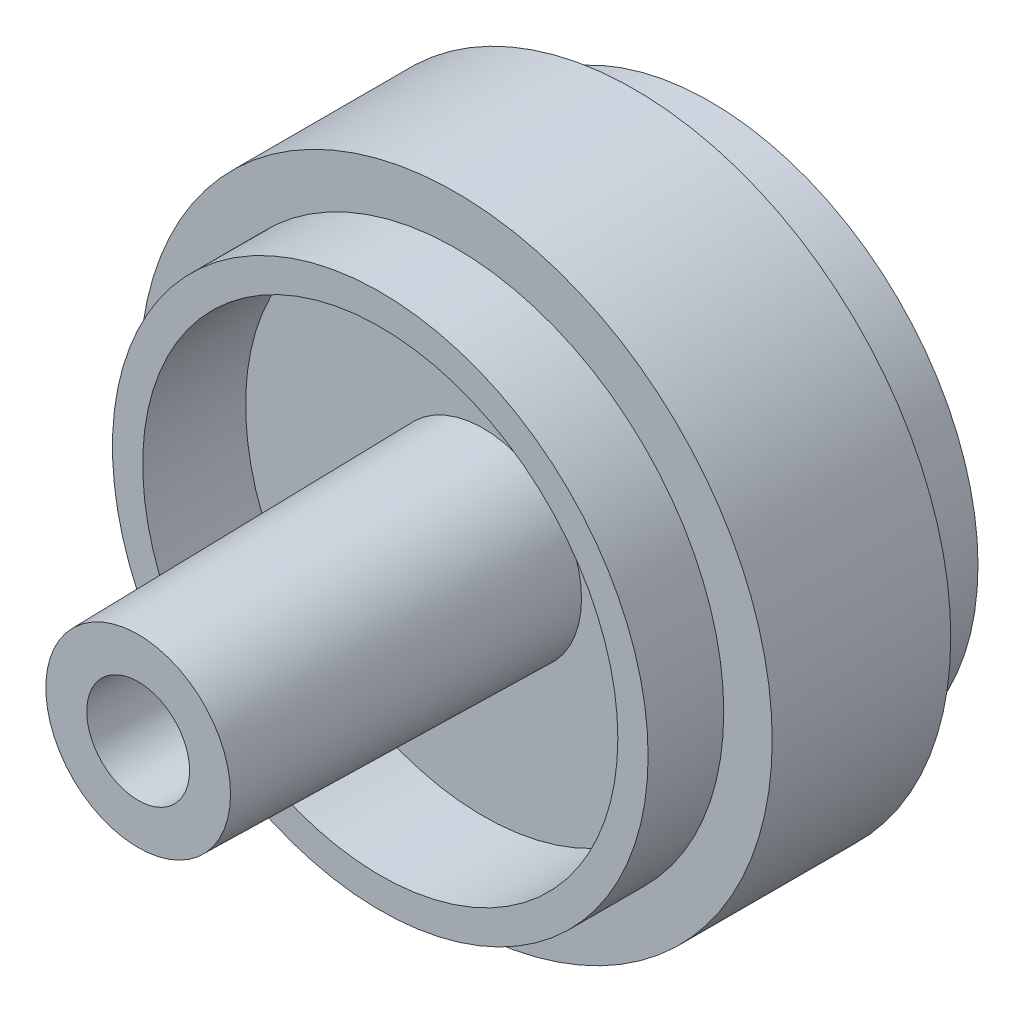
ISO-10303-21;
HEADER;
FILE_DESCRIPTION(('STEP AP214'),'2;1');
FILE_NAME('part.step','',(''),(''),'','','');
FILE_SCHEMA(('AUTOMOTIVE_DESIGN { 1 0 10303 214 1 1 1 1 }'));
ENDSEC;
DATA;
#1=APPLICATION_CONTEXT('core data for automotive mechanical design processes');
#2=APPLICATION_PROTOCOL_DEFINITION('international standard','automotive_design',2000,#1);
#3=PRODUCT_CONTEXT('',#1,'mechanical');
#4=PRODUCT('Part','Part','',(#3));
#5=PRODUCT_RELATED_PRODUCT_CATEGORY('part','',(#4));
#6=PRODUCT_DEFINITION_FORMATION('','',#4);
#7=PRODUCT_DEFINITION_CONTEXT('part definition',#1,'design');
#8=PRODUCT_DEFINITION('design','',#6,#7);
#9=PRODUCT_DEFINITION_SHAPE('','',#8);
#10=(LENGTH_UNIT() NAMED_UNIT(*) SI_UNIT(.MILLI.,.METRE.));
#11=(NAMED_UNIT(*) PLANE_ANGLE_UNIT() SI_UNIT($,.RADIAN.));
#12=(NAMED_UNIT(*) SI_UNIT($,.STERADIAN.) SOLID_ANGLE_UNIT());
#13=UNCERTAINTY_MEASURE_WITH_UNIT(LENGTH_MEASURE(1.E-05),#10,'distance_accuracy_value','');
#14=(GEOMETRIC_REPRESENTATION_CONTEXT(3) GLOBAL_UNCERTAINTY_ASSIGNED_CONTEXT((#13)) GLOBAL_UNIT_ASSIGNED_CONTEXT((#10,
#11,#12)) REPRESENTATION_CONTEXT('',''));
#15=CARTESIAN_POINT('',(0.,0.,0.));
#16=DIRECTION('',(0.,0.,1.));
#17=DIRECTION('',(1.,0.,0.));
#18=AXIS2_PLACEMENT_3D('',#15,#16,#17);
#19=CARTESIAN_POINT('',(0.,0.,8.83385145527518));
#20=DIRECTION('',(0.,0.,1.));
#21=DIRECTION('',(1.,0.,0.));
#22=AXIS2_PLACEMENT_3D('',#19,#20,#21);
#23=CYLINDRICAL_SURFACE('',#22,3.25);
#24=CARTESIAN_POINT('',(0.,0.,-5.45));
#25=DIRECTION('',(0.,0.,1.));
#26=DIRECTION('',(1.,0.,0.));
#27=AXIS2_PLACEMENT_3D('',#24,#25,#26);
#28=CIRCLE('',#27,3.25);
#29=CARTESIAN_POINT('',(3.25,0.,-5.45));
#30=VERTEX_POINT('',#29);
#31=EDGE_CURVE('E83',#30,#30,#28,.T.);
#32=ORIENTED_EDGE('',*,*,#31,.F.);
#33=EDGE_LOOP('',(#32));
#34=FACE_BOUND('',#33,.T.);
#35=CARTESIAN_POINT('',(0.,0.,1.05));
#36=DIRECTION('',(0.,0.,1.));
#37=DIRECTION('',(1.,0.,0.));
#38=AXIS2_PLACEMENT_3D('',#35,#36,#37);
#39=CIRCLE('',#38,3.25);
#40=CARTESIAN_POINT('',(3.25,0.,1.05));
#41=VERTEX_POINT('',#40);
#42=EDGE_CURVE('E10',#41,#41,#39,.F.);
#43=ORIENTED_EDGE('',*,*,#42,.F.);
#44=EDGE_LOOP('',(#43));
#45=FACE_BOUND('',#44,.T.);
#46=ADVANCED_FACE('F33',(#34,#45),#23,.F.);
#47=CARTESIAN_POINT('',(0.,3.25,-5.45));
#48=DIRECTION('',(0.,0.,1.));
#49=DIRECTION('',(1.,0.,0.));
#50=AXIS2_PLACEMENT_3D('',#47,#48,#49);
#51=PLANE('',#50);
#52=CARTESIAN_POINT('',(0.,0.,-5.45));
#53=DIRECTION('',(0.,0.,1.));
#54=DIRECTION('',(1.,0.,0.));
#55=AXIS2_PLACEMENT_3D('',#52,#53,#54);
#56=CIRCLE('',#55,4.25);
#57=CARTESIAN_POINT('',(4.25,0.,-5.45));
#58=VERTEX_POINT('',#57);
#59=EDGE_CURVE('E40',#58,#58,#56,.T.);
#60=ORIENTED_EDGE('',*,*,#59,.F.);
#61=EDGE_LOOP('',(#60));
#62=FACE_BOUND('',#61,.T.);
#63=ORIENTED_EDGE('',*,*,#31,.T.);
#64=EDGE_LOOP('',(#63));
#65=FACE_BOUND('',#64,.T.);
#66=ADVANCED_FACE('F35',(#62,#65),#51,.F.);
#67=CARTESIAN_POINT('',(0.,0.,8.83385145527518));
#68=DIRECTION('',(0.,0.,1.));
#69=DIRECTION('',(1.,0.,0.));
#70=AXIS2_PLACEMENT_3D('',#67,#68,#69);
#71=CYLINDRICAL_SURFACE('',#70,4.25);
#72=CARTESIAN_POINT('',(0.,0.,-2.05));
#73=DIRECTION('',(0.,0.,1.));
#74=DIRECTION('',(1.,0.,0.));
#75=AXIS2_PLACEMENT_3D('',#72,#73,#74);
#76=CIRCLE('',#75,4.25);
#77=CARTESIAN_POINT('',(4.25,0.,-2.05));
#78=VERTEX_POINT('',#77);
#79=EDGE_CURVE('E44',#78,#78,#76,.T.);
#80=ORIENTED_EDGE('',*,*,#79,.F.);
#81=EDGE_LOOP('',(#80));
#82=FACE_BOUND('',#81,.T.);
#83=ORIENTED_EDGE('',*,*,#59,.T.);
#84=EDGE_LOOP('',(#83));
#85=FACE_BOUND('',#84,.T.);
#86=ADVANCED_FACE('F119',(#82,#85),#71,.T.);
#87=CARTESIAN_POINT('',(0.,4.25,-2.05));
#88=DIRECTION('',(0.,0.,1.));
#89=DIRECTION('',(1.,0.,0.));
#90=AXIS2_PLACEMENT_3D('',#87,#88,#89);
#91=PLANE('',#90);
#92=CARTESIAN_POINT('',(0.,0.,-2.05));
#93=DIRECTION('',(0.,0.,1.));
#94=DIRECTION('',(1.,0.,0.));
#95=AXIS2_PLACEMENT_3D('',#92,#93,#94);
#96=CIRCLE('',#95,7.85);
#97=CARTESIAN_POINT('',(7.85,0.,-2.05));
#98=VERTEX_POINT('',#97);
#99=EDGE_CURVE('E48',#98,#98,#96,.T.);
#100=ORIENTED_EDGE('',*,*,#99,.F.);
#101=EDGE_LOOP('',(#100));
#102=FACE_BOUND('',#101,.T.);
#103=ORIENTED_EDGE('',*,*,#79,.T.);
#104=EDGE_LOOP('',(#103));
#105=FACE_BOUND('',#104,.T.);
#106=ADVANCED_FACE('F165',(#102,#105),#91,.F.);
#107=CARTESIAN_POINT('',(0.,0.,8.83385145527518));
#108=DIRECTION('',(0.,0.,1.));
#109=DIRECTION('',(1.,0.,0.));
#110=AXIS2_PLACEMENT_3D('',#107,#108,#109);
#111=CYLINDRICAL_SURFACE('',#110,7.85);
#112=CARTESIAN_POINT('',(0.,0.,-5.45));
#113=DIRECTION('',(0.,0.,1.));
#114=DIRECTION('',(1.,0.,0.));
#115=AXIS2_PLACEMENT_3D('',#112,#113,#114);
#116=CIRCLE('',#115,7.85);
#117=CARTESIAN_POINT('',(7.85,0.,-5.45));
#118=VERTEX_POINT('',#117);
#119=EDGE_CURVE('E53',#118,#118,#116,.T.);
#120=ORIENTED_EDGE('',*,*,#119,.F.);
#121=EDGE_LOOP('',(#120));
#122=FACE_BOUND('',#121,.T.);
#123=ORIENTED_EDGE('',*,*,#99,.T.);
#124=EDGE_LOOP('',(#123));
#125=FACE_BOUND('',#124,.T.);
#126=ADVANCED_FACE('F161',(#122,#125),#111,.F.);
#127=CARTESIAN_POINT('',(0.,7.85,-5.45));
#128=DIRECTION('',(0.,0.,1.));
#129=DIRECTION('',(1.,0.,0.));
#130=AXIS2_PLACEMENT_3D('',#127,#128,#129);
#131=PLANE('',#130);
#132=CARTESIAN_POINT('',(0.,0.,-5.45));
#133=DIRECTION('',(0.,0.,1.));
#134=DIRECTION('',(1.,0.,0.));
#135=AXIS2_PLACEMENT_3D('',#132,#133,#134);
#136=CIRCLE('',#135,8.85);
#137=CARTESIAN_POINT('',(8.85,0.,-5.45));
#138=VERTEX_POINT('',#137);
#139=EDGE_CURVE('E56',#138,#138,#136,.T.);
#140=ORIENTED_EDGE('',*,*,#139,.F.);
#141=EDGE_LOOP('',(#140));
#142=FACE_BOUND('',#141,.T.);
#143=ORIENTED_EDGE('',*,*,#119,.T.);
#144=EDGE_LOOP('',(#143));
#145=FACE_BOUND('',#144,.T.);
#146=ADVANCED_FACE('F157',(#142,#145),#131,.F.);
#147=CARTESIAN_POINT('',(0.,0.,8.83385145527518));
#148=DIRECTION('',(0.,0.,1.));
#149=DIRECTION('',(1.,0.,0.));
#150=AXIS2_PLACEMENT_3D('',#147,#148,#149);
#151=CYLINDRICAL_SURFACE('',#150,8.85);
#152=CARTESIAN_POINT('',(0.,0.,-2.95));
#153=DIRECTION('',(0.,0.,1.));
#154=DIRECTION('',(1.,0.,0.));
#155=AXIS2_PLACEMENT_3D('',#152,#153,#154);
#156=CIRCLE('',#155,8.85);
#157=CARTESIAN_POINT('',(8.85,0.,-2.95));
#158=VERTEX_POINT('',#157);
#159=EDGE_CURVE('E59',#158,#158,#156,.T.);
#160=ORIENTED_EDGE('',*,*,#159,.F.);
#161=EDGE_LOOP('',(#160));
#162=FACE_BOUND('',#161,.T.);
#163=ORIENTED_EDGE('',*,*,#139,.T.);
#164=EDGE_LOOP('',(#163));
#165=FACE_BOUND('',#164,.T.);
#166=ADVANCED_FACE('F153',(#162,#165),#151,.T.);
#167=CARTESIAN_POINT('',(0.,8.85,-2.95));
#168=DIRECTION('',(0.,0.,1.));
#169=DIRECTION('',(1.,0.,0.));
#170=AXIS2_PLACEMENT_3D('',#167,#168,#169);
#171=PLANE('',#170);
#172=CARTESIAN_POINT('',(0.,0.,-2.95));
#173=DIRECTION('',(0.,0.,1.));
#174=DIRECTION('',(1.,0.,0.));
#175=AXIS2_PLACEMENT_3D('',#172,#173,#174);
#176=CIRCLE('',#175,10.45);
#177=CARTESIAN_POINT('',(10.45,0.,-2.95));
#178=VERTEX_POINT('',#177);
#179=EDGE_CURVE('E62',#178,#178,#176,.T.);
#180=ORIENTED_EDGE('',*,*,#179,.F.);
#181=EDGE_LOOP('',(#180));
#182=FACE_BOUND('',#181,.T.);
#183=ORIENTED_EDGE('',*,*,#159,.T.);
#184=EDGE_LOOP('',(#183));
#185=FACE_BOUND('',#184,.T.);
#186=ADVANCED_FACE('F149',(#182,#185),#171,.F.);
#187=CARTESIAN_POINT('',(0.,0.,8.83385145527518));
#188=DIRECTION('',(0.,0.,1.));
#189=DIRECTION('',(1.,0.,0.));
#190=AXIS2_PLACEMENT_3D('',#187,#188,#189);
#191=CYLINDRICAL_SURFACE('',#190,10.45);
#192=CARTESIAN_POINT('',(0.,0.,2.95));
#193=DIRECTION('',(0.,0.,1.));
#194=DIRECTION('',(1.,0.,0.));
#195=AXIS2_PLACEMENT_3D('',#192,#193,#194);
#196=CIRCLE('',#195,10.45);
#197=CARTESIAN_POINT('',(10.45,0.,2.95));
#198=VERTEX_POINT('',#197);
#199=EDGE_CURVE('E65',#198,#198,#196,.T.);
#200=ORIENTED_EDGE('',*,*,#199,.F.);
#201=EDGE_LOOP('',(#200));
#202=FACE_BOUND('',#201,.T.);
#203=ORIENTED_EDGE('',*,*,#179,.T.);
#204=EDGE_LOOP('',(#203));
#205=FACE_BOUND('',#204,.T.);
#206=ADVANCED_FACE('F145',(#202,#205),#191,.T.);
#207=CARTESIAN_POINT('',(0.,8.85,2.95));
#208=DIRECTION('',(0.,0.,-1.));
#209=DIRECTION('',(-1.,0.,0.));
#210=AXIS2_PLACEMENT_3D('',#207,#208,#209);
#211=PLANE('',#210);
#212=CARTESIAN_POINT('',(0.,0.,2.95));
#213=DIRECTION('',(0.,0.,1.));
#214=DIRECTION('',(1.,0.,0.));
#215=AXIS2_PLACEMENT_3D('',#212,#213,#214);
#216=CIRCLE('',#215,8.85);
#217=CARTESIAN_POINT('',(8.85,0.,2.95));
#218=VERTEX_POINT('',#217);
#219=EDGE_CURVE('E68',#218,#218,#216,.T.);
#220=ORIENTED_EDGE('',*,*,#219,.F.);
#221=EDGE_LOOP('',(#220));
#222=FACE_BOUND('',#221,.T.);
#223=ORIENTED_EDGE('',*,*,#199,.T.);
#224=EDGE_LOOP('',(#223));
#225=FACE_BOUND('',#224,.T.);
#226=ADVANCED_FACE('F141',(#222,#225),#211,.F.);
#227=CARTESIAN_POINT('',(0.,0.,8.83385145527518));
#228=DIRECTION('',(0.,0.,1.));
#229=DIRECTION('',(1.,0.,0.));
#230=AXIS2_PLACEMENT_3D('',#227,#228,#229);
#231=CYLINDRICAL_SURFACE('',#230,8.85);
#232=CARTESIAN_POINT('',(0.,0.,5.45));
#233=DIRECTION('',(0.,0.,1.));
#234=DIRECTION('',(1.,0.,0.));
#235=AXIS2_PLACEMENT_3D('',#232,#233,#234);
#236=CIRCLE('',#235,8.85);
#237=CARTESIAN_POINT('',(8.85,0.,5.45));
#238=VERTEX_POINT('',#237);
#239=EDGE_CURVE('E71',#238,#238,#236,.T.);
#240=ORIENTED_EDGE('',*,*,#239,.F.);
#241=EDGE_LOOP('',(#240));
#242=FACE_BOUND('',#241,.T.);
#243=ORIENTED_EDGE('',*,*,#219,.T.);
#244=EDGE_LOOP('',(#243));
#245=FACE_BOUND('',#244,.T.);
#246=ADVANCED_FACE('F137',(#242,#245),#231,.T.);
#247=CARTESIAN_POINT('',(0.,7.85,5.45));
#248=DIRECTION('',(0.,0.,-1.));
#249=DIRECTION('',(-1.,0.,0.));
#250=AXIS2_PLACEMENT_3D('',#247,#248,#249);
#251=PLANE('',#250);
#252=CARTESIAN_POINT('',(0.,0.,5.45));
#253=DIRECTION('',(0.,0.,1.));
#254=DIRECTION('',(1.,0.,0.));
#255=AXIS2_PLACEMENT_3D('',#252,#253,#254);
#256=CIRCLE('',#255,7.85);
#257=CARTESIAN_POINT('',(7.85,0.,5.45));
#258=VERTEX_POINT('',#257);
#259=EDGE_CURVE('E74',#258,#258,#256,.T.);
#260=ORIENTED_EDGE('',*,*,#259,.F.);
#261=EDGE_LOOP('',(#260));
#262=FACE_BOUND('',#261,.T.);
#263=ORIENTED_EDGE('',*,*,#239,.T.);
#264=EDGE_LOOP('',(#263));
#265=FACE_BOUND('',#264,.T.);
#266=ADVANCED_FACE('F133',(#262,#265),#251,.F.);
#267=CARTESIAN_POINT('',(0.,0.,8.83385145527518));
#268=DIRECTION('',(0.,0.,1.));
#269=DIRECTION('',(1.,0.,0.));
#270=AXIS2_PLACEMENT_3D('',#267,#268,#269);
#271=CYLINDRICAL_SURFACE('',#270,7.85);
#272=CARTESIAN_POINT('',(0.,0.,2.05));
#273=DIRECTION('',(0.,0.,1.));
#274=DIRECTION('',(1.,0.,0.));
#275=AXIS2_PLACEMENT_3D('',#272,#273,#274);
#276=CIRCLE('',#275,7.85);
#277=CARTESIAN_POINT('',(7.85,0.,2.05));
#278=VERTEX_POINT('',#277);
#279=EDGE_CURVE('E77',#278,#278,#276,.T.);
#280=ORIENTED_EDGE('',*,*,#279,.F.);
#281=EDGE_LOOP('',(#280));
#282=FACE_BOUND('',#281,.T.);
#283=ORIENTED_EDGE('',*,*,#259,.T.);
#284=EDGE_LOOP('',(#283));
#285=FACE_BOUND('',#284,.T.);
#286=ADVANCED_FACE('F129',(#282,#285),#271,.F.);
#287=CARTESIAN_POINT('',(0.,3.25,2.05));
#288=DIRECTION('',(0.,0.,-1.));
#289=DIRECTION('',(-1.,0.,0.));
#290=AXIS2_PLACEMENT_3D('',#287,#288,#289);
#291=PLANE('',#290);
#292=CARTESIAN_POINT('',(0.,0.,2.05));
#293=DIRECTION('',(0.,0.,1.));
#294=DIRECTION('',(1.,0.,0.));
#295=AXIS2_PLACEMENT_3D('',#292,#293,#294);
#296=CIRCLE('',#295,3.25);
#297=CARTESIAN_POINT('',(3.25,0.,2.05));
#298=VERTEX_POINT('',#297);
#299=EDGE_CURVE('E80',#298,#298,#296,.T.);
#300=ORIENTED_EDGE('',*,*,#299,.F.);
#301=EDGE_LOOP('',(#300));
#302=FACE_BOUND('',#301,.T.);
#303=ORIENTED_EDGE('',*,*,#279,.T.);
#304=EDGE_LOOP('',(#303));
#305=FACE_BOUND('',#304,.T.);
#306=ADVANCED_FACE('F126',(#302,#305),#291,.F.);
#307=CARTESIAN_POINT('',(0.,0.,1.05));
#308=DIRECTION('',(0.,0.,1.));
#309=DIRECTION('',(1.,0.,0.));
#310=AXIS2_PLACEMENT_3D('',#307,#308,#309);
#311=PLANE('',#310);
#312=CARTESIAN_POINT('',(0.,0.,1.05));
#313=DIRECTION('',(0.,0.,1.));
#314=DIRECTION('',(1.,0.,0.));
#315=AXIS2_PLACEMENT_3D('',#312,#313,#314);
#316=CIRCLE('',#315,1.5);
#317=CARTESIAN_POINT('',(1.5,0.,1.05));
#318=VERTEX_POINT('',#317);
#319=EDGE_CURVE('E86',#318,#318,#316,.T.);
#320=ORIENTED_EDGE('',*,*,#319,.T.);
#321=EDGE_LOOP('',(#320));
#322=FACE_BOUND('',#321,.T.);
#323=ORIENTED_EDGE('',*,*,#42,.T.);
#324=EDGE_LOOP('',(#323));
#325=FACE_BOUND('',#324,.T.);
#326=ADVANCED_FACE('F125',(#322,#325),#311,.F.);
#327=CARTESIAN_POINT('',(0.,0.,1.05));
#328=DIRECTION('',(0.,0.,1.));
#329=DIRECTION('',(1.,0.,0.));
#330=AXIS2_PLACEMENT_3D('',#327,#328,#329);
#331=CYLINDRICAL_SURFACE('',#330,1.5);
#332=ORIENTED_EDGE('',*,*,#319,.F.);
#333=EDGE_LOOP('',(#332));
#334=FACE_BOUND('',#333,.T.);
#335=CARTESIAN_POINT('',(0.,0.,2.05));
#336=DIRECTION('',(0.,0.,1.));
#337=DIRECTION('',(1.,0.,0.));
#338=AXIS2_PLACEMENT_3D('',#335,#336,#337);
#339=CIRCLE('',#338,1.5);
#340=CARTESIAN_POINT('',(1.5,0.,2.05));
#341=VERTEX_POINT('',#340);
#342=EDGE_CURVE('E93',#341,#341,#339,.T.);
#343=ORIENTED_EDGE('',*,*,#342,.T.);
#344=EDGE_LOOP('',(#343));
#345=FACE_BOUND('',#344,.T.);
#346=ADVANCED_FACE('F99',(#334,#345),#331,.F.);
#347=CARTESIAN_POINT('',(0.,0.,13.45));
#348=DIRECTION('',(0.,0.,1.));
#349=DIRECTION('',(1.,0.,0.));
#350=AXIS2_PLACEMENT_3D('',#347,#348,#349);
#351=PLANE('',#350);
#352=CARTESIAN_POINT('',(0.,0.,13.45));
#353=DIRECTION('',(0.,0.,1.));
#354=DIRECTION('',(1.,0.,0.));
#355=AXIS2_PLACEMENT_3D('',#352,#353,#354);
#356=CIRCLE('',#355,3.05101225981832);
#357=CARTESIAN_POINT('',(3.05101225981832,0.,13.45));
#358=VERTEX_POINT('',#357);
#359=EDGE_CURVE('E89',#358,#358,#356,.T.);
#360=ORIENTED_EDGE('',*,*,#359,.T.);
#361=EDGE_LOOP('',(#360));
#362=FACE_BOUND('',#361,.T.);
#363=CARTESIAN_POINT('',(0.,0.,13.45));
#364=DIRECTION('',(0.,0.,1.));
#365=DIRECTION('',(1.,0.,0.));
#366=AXIS2_PLACEMENT_3D('',#363,#364,#365);
#367=CIRCLE('',#366,1.69898774018168);
#368=CARTESIAN_POINT('',(1.69898774018168,0.,13.45));
#369=VERTEX_POINT('',#368);
#370=EDGE_CURVE('E90',#369,#369,#367,.T.);
#371=ORIENTED_EDGE('',*,*,#370,.F.);
#372=EDGE_LOOP('',(#371));
#373=FACE_BOUND('',#372,.T.);
#374=ADVANCED_FACE('F109',(#362,#373),#351,.T.);
#375=CARTESIAN_POINT('',(0.,0.,2.05));
#376=DIRECTION('',(0.,0.,-1.));
#377=DIRECTION('',(1.,0.,0.));
#378=AXIS2_PLACEMENT_3D('',#375,#376,#377);
#379=CONICAL_SURFACE('',#378,3.25,0.0174532925199433);
#380=ORIENTED_EDGE('',*,*,#359,.F.);
#381=EDGE_LOOP('',(#380));
#382=FACE_BOUND('',#381,.T.);
#383=ORIENTED_EDGE('',*,*,#299,.T.);
#384=EDGE_LOOP('',(#383));
#385=FACE_BOUND('',#384,.T.);
#386=ADVANCED_FACE('F103',(#382,#385),#379,.T.);
#387=CARTESIAN_POINT('',(0.,0.,2.05));
#388=DIRECTION('',(0.,0.,1.));
#389=DIRECTION('',(1.,0.,0.));
#390=AXIS2_PLACEMENT_3D('',#387,#388,#389);
#391=CONICAL_SURFACE('',#390,1.5,0.0174532925199433);
#392=ORIENTED_EDGE('',*,*,#370,.T.);
#393=EDGE_LOOP('',(#392));
#394=FACE_BOUND('',#393,.T.);
#395=ORIENTED_EDGE('',*,*,#342,.F.);
#396=EDGE_LOOP('',(#395));
#397=FACE_BOUND('',#396,.T.);
#398=ADVANCED_FACE('F101',(#394,#397),#391,.F.);
#399=CLOSED_SHELL('',(#46,#66,#86,#106,#126,#146,#166,#186,#206,#226,#246,#266,#286,#306,#326,
#346,#374,#386,#398));
#400=MANIFOLD_SOLID_BREP('B2',#399);
#401=ADVANCED_BREP_SHAPE_REPRESENTATION('',(#18,#400),#14);
#402=SHAPE_DEFINITION_REPRESENTATION(#9,#401);
ENDSEC;
END-ISO-10303-21;
